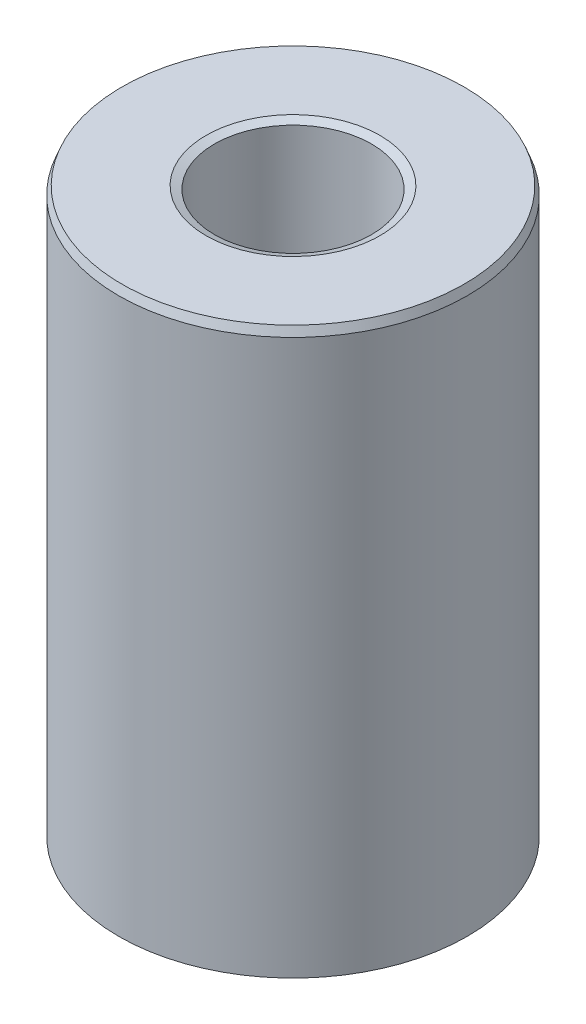
ISO-10303-21;
HEADER;
FILE_DESCRIPTION(('STEP AP214'),'2;1');
FILE_NAME('part.step','',(''),(''),'','','');
FILE_SCHEMA(('AUTOMOTIVE_DESIGN { 1 0 10303 214 1 1 1 1 }'));
ENDSEC;
DATA;
#1=APPLICATION_CONTEXT('core data for automotive mechanical design processes');
#2=APPLICATION_PROTOCOL_DEFINITION('international standard','automotive_design',2000,#1);
#3=PRODUCT_CONTEXT('',#1,'mechanical');
#4=PRODUCT('Part','Part','',(#3));
#5=PRODUCT_RELATED_PRODUCT_CATEGORY('part','',(#4));
#6=PRODUCT_DEFINITION_FORMATION('','',#4);
#7=PRODUCT_DEFINITION_CONTEXT('part definition',#1,'design');
#8=PRODUCT_DEFINITION('design','',#6,#7);
#9=PRODUCT_DEFINITION_SHAPE('','',#8);
#10=(LENGTH_UNIT() NAMED_UNIT(*) SI_UNIT(.MILLI.,.METRE.));
#11=(NAMED_UNIT(*) PLANE_ANGLE_UNIT() SI_UNIT($,.RADIAN.));
#12=(NAMED_UNIT(*) SI_UNIT($,.STERADIAN.) SOLID_ANGLE_UNIT());
#13=UNCERTAINTY_MEASURE_WITH_UNIT(LENGTH_MEASURE(1.E-05),#10,'distance_accuracy_value','');
#14=(GEOMETRIC_REPRESENTATION_CONTEXT(3) GLOBAL_UNCERTAINTY_ASSIGNED_CONTEXT((#13)) GLOBAL_UNIT_ASSIGNED_CONTEXT((#10,
#11,#12)) REPRESENTATION_CONTEXT('',''));
#15=CARTESIAN_POINT('',(0.,0.,0.));
#16=DIRECTION('',(0.,0.,1.));
#17=DIRECTION('',(1.,0.,0.));
#18=AXIS2_PLACEMENT_3D('',#15,#16,#17);
#19=CARTESIAN_POINT('',(0.,130.047355790658,0.));
#20=DIRECTION('',(0.,-1.,0.));
#21=DIRECTION('',(0.,0.,-1.));
#22=AXIS2_PLACEMENT_3D('',#19,#20,#21);
#23=CYLINDRICAL_SURFACE('',#22,40.);
#24=CARTESIAN_POINT('',(0.,0.740756808250698,0.));
#25=DIRECTION('',(0.,1.,0.));
#26=DIRECTION('',(0.,0.,1.));
#27=AXIS2_PLACEMENT_3D('',#24,#25,#26);
#28=CIRCLE('',#27,40.);
#29=CARTESIAN_POINT('',(0.,0.740756808250698,40.));
#30=VERTEX_POINT('',#29);
#31=EDGE_CURVE('E10',#30,#30,#28,.T.);
#32=ORIENTED_EDGE('',*,*,#31,.T.);
#33=EDGE_LOOP('',(#32));
#34=FACE_BOUND('',#33,.T.);
#35=CARTESIAN_POINT('',(0.,128.124007330979,0.));
#36=DIRECTION('',(0.,1.,0.));
#37=DIRECTION('',(0.,0.,1.));
#38=AXIS2_PLACEMENT_3D('',#35,#36,#37);
#39=CIRCLE('',#38,40.);
#40=CARTESIAN_POINT('',(0.,128.124007330979,-40.));
#41=VERTEX_POINT('',#40);
#42=EDGE_CURVE('E50',#41,#41,#39,.F.);
#43=ORIENTED_EDGE('',*,*,#42,.T.);
#44=EDGE_LOOP('',(#43));
#45=FACE_BOUND('',#44,.T.);
#46=ADVANCED_FACE('F39',(#34,#45),#23,.T.);
#47=CARTESIAN_POINT('',(0.,130.047355790658,0.));
#48=DIRECTION('',(0.,1.,0.));
#49=DIRECTION('',(0.,0.,1.));
#50=AXIS2_PLACEMENT_3D('',#47,#48,#49);
#51=PLANE('',#50);
#52=CARTESIAN_POINT('',(0.,130.047355790658,0.));
#53=DIRECTION('',(0.,1.,0.));
#54=DIRECTION('',(0.,0.,1.));
#55=AXIS2_PLACEMENT_3D('',#52,#53,#54);
#56=CIRCLE('',#55,19.9612503892838);
#57=CARTESIAN_POINT('',(0.,130.047355790658,19.9612503892838));
#58=VERTEX_POINT('',#57);
#59=EDGE_CURVE('E58',#58,#58,#56,.F.);
#60=ORIENTED_EDGE('',*,*,#59,.T.);
#61=EDGE_LOOP('',(#60));
#62=FACE_BOUND('',#61,.T.);
#63=CARTESIAN_POINT('',(0.,130.047355790658,0.));
#64=DIRECTION('',(0.,1.,0.));
#65=DIRECTION('',(0.,0.,1.));
#66=AXIS2_PLACEMENT_3D('',#63,#64,#65);
#67=CIRCLE('',#66,39.2592431917493);
#68=CARTESIAN_POINT('',(0.,130.047355790658,-39.2592431917493));
#69=VERTEX_POINT('',#68);
#70=EDGE_CURVE('E61',#69,#69,#67,.T.);
#71=ORIENTED_EDGE('',*,*,#70,.T.);
#72=EDGE_LOOP('',(#71));
#73=FACE_BOUND('',#72,.T.);
#74=ADVANCED_FACE('F88',(#62,#73),#51,.T.);
#75=CARTESIAN_POINT('',(0.,0.,0.));
#76=DIRECTION('',(0.,1.,0.));
#77=DIRECTION('',(0.,0.,1.));
#78=AXIS2_PLACEMENT_3D('',#75,#76,#77);
#79=PLANE('',#78);
#80=CARTESIAN_POINT('',(0.,0.,0.));
#81=DIRECTION('',(0.,1.,0.));
#82=DIRECTION('',(0.,0.,1.));
#83=AXIS2_PLACEMENT_3D('',#80,#81,#82);
#84=CIRCLE('',#83,18.778658737856);
#85=CARTESIAN_POINT('',(0.,0.,-18.778658737856));
#86=VERTEX_POINT('',#85);
#87=EDGE_CURVE('E51',#86,#86,#84,.T.);
#88=ORIENTED_EDGE('',*,*,#87,.T.);
#89=EDGE_LOOP('',(#88));
#90=FACE_BOUND('',#89,.T.);
#91=CARTESIAN_POINT('',(0.,0.,0.));
#92=DIRECTION('',(0.,1.,0.));
#93=DIRECTION('',(0.,0.,1.));
#94=AXIS2_PLACEMENT_3D('',#91,#92,#93);
#95=CIRCLE('',#94,38.0766515403214);
#96=CARTESIAN_POINT('',(0.,0.,38.0766515403214));
#97=VERTEX_POINT('',#96);
#98=EDGE_CURVE('E54',#97,#97,#95,.F.);
#99=ORIENTED_EDGE('',*,*,#98,.T.);
#100=EDGE_LOOP('',(#99));
#101=FACE_BOUND('',#100,.T.);
#102=ADVANCED_FACE('F83',(#90,#101),#79,.F.);
#103=CARTESIAN_POINT('',(0.,130.047355790658,0.));
#104=DIRECTION('',(0.,-1.,0.));
#105=DIRECTION('',(0.,0.,-1.));
#106=AXIS2_PLACEMENT_3D('',#103,#104,#105);
#107=CYLINDRICAL_SURFACE('',#106,18.0379019296053);
#108=CARTESIAN_POINT('',(0.,129.306598982407,0.));
#109=DIRECTION('',(0.,1.,0.));
#110=DIRECTION('',(0.,0.,1.));
#111=AXIS2_PLACEMENT_3D('',#108,#109,#110);
#112=CIRCLE('',#111,18.0379019296053);
#113=CARTESIAN_POINT('',(0.,129.306598982407,18.0379019296053));
#114=VERTEX_POINT('',#113);
#115=EDGE_CURVE('E67',#114,#114,#112,.T.);
#116=ORIENTED_EDGE('',*,*,#115,.T.);
#117=EDGE_LOOP('',(#116));
#118=FACE_BOUND('',#117,.T.);
#119=CARTESIAN_POINT('',(0.,1.92334845967856,0.));
#120=DIRECTION('',(0.,1.,0.));
#121=DIRECTION('',(0.,0.,1.));
#122=AXIS2_PLACEMENT_3D('',#119,#120,#121);
#123=CIRCLE('',#122,18.0379019296053);
#124=CARTESIAN_POINT('',(0.,1.92334845967856,-18.0379019296053));
#125=VERTEX_POINT('',#124);
#126=EDGE_CURVE('E69',#125,#125,#123,.F.);
#127=ORIENTED_EDGE('',*,*,#126,.T.);
#128=EDGE_LOOP('',(#127));
#129=FACE_BOUND('',#128,.T.);
#130=ADVANCED_FACE('F71',(#118,#129),#107,.F.);
#131=CARTESIAN_POINT('',(0.,129.306598982407,0.));
#132=DIRECTION('',(0.,1.,0.));
#133=DIRECTION('',(0.,0.,1.));
#134=AXIS2_PLACEMENT_3D('',#131,#132,#133);
#135=CONICAL_SURFACE('',#134,18.0379019296053,1.20316629536968);
#136=ORIENTED_EDGE('',*,*,#59,.F.);
#137=EDGE_LOOP('',(#136));
#138=FACE_BOUND('',#137,.T.);
#139=ORIENTED_EDGE('',*,*,#115,.F.);
#140=EDGE_LOOP('',(#139));
#141=FACE_BOUND('',#140,.T.);
#142=ADVANCED_FACE('F77',(#138,#141),#135,.F.);
#143=CARTESIAN_POINT('',(0.,0.,0.));
#144=DIRECTION('',(0.,-1.,0.));
#145=DIRECTION('',(0.,0.,-1.));
#146=AXIS2_PLACEMENT_3D('',#143,#144,#145);
#147=CONICAL_SURFACE('',#146,18.778658737856,0.367630031425209);
#148=CARTESIAN_POINT('',(0.,1.92334845967856,-18.0379019296053));
#149=CARTESIAN_POINT('',(0.,1.90331357989025,-18.0456181463579));
#150=CARTESIAN_POINT('',(0.,1.88327870010193,-18.0533343631105));
#151=CARTESIAN_POINT('',(0.,1.84320894052529,-18.0687667966157));
#152=CARTESIAN_POINT('',(0.,1.82317406073697,-18.0764830133684));
#153=CARTESIAN_POINT('',(0.,1.78310430116034,-18.0919154468736));
#154=CARTESIAN_POINT('',(0.,1.76306942137202,-18.0996316636262));
#155=CARTESIAN_POINT('',(0.,1.72299966179538,-18.1150640971314));
#156=CARTESIAN_POINT('',(0.,1.70296478200706,-18.122780313884));
#157=CARTESIAN_POINT('',(0.,1.66289502243043,-18.1382127473892));
#158=CARTESIAN_POINT('',(0.,1.64286014264211,-18.1459289641419));
#159=CARTESIAN_POINT('',(0.,1.60279038306547,-18.1613613976471));
#160=CARTESIAN_POINT('',(0.,1.58275550327715,-18.1690776143997));
#161=CARTESIAN_POINT('',(0.,1.54268574370052,-18.1845100479049));
#162=CARTESIAN_POINT('',(0.,1.5226508639122,-18.1922262646575));
#163=CARTESIAN_POINT('',(0.,1.48258110433556,-18.2076586981627));
#164=CARTESIAN_POINT('',(0.,1.46254622454724,-18.2153749149154));
#165=CARTESIAN_POINT('',(0.,1.4224764649706,-18.2308073484206));
#166=CARTESIAN_POINT('',(0.,1.40244158518229,-18.2385235651732));
#167=CARTESIAN_POINT('',(0.,1.36237182560565,-18.2539559986784));
#168=CARTESIAN_POINT('',(0.,1.34233694581733,-18.261672215431));
#169=CARTESIAN_POINT('',(0.,1.30226718624069,-18.2771046489362));
#170=CARTESIAN_POINT('',(0.,1.28223230645238,-18.2848208656889));
#171=CARTESIAN_POINT('',(0.,1.24216254687574,-18.3002532991941));
#172=CARTESIAN_POINT('',(0.,1.22212766708742,-18.3079695159467));
#173=CARTESIAN_POINT('',(0.,1.18205790751078,-18.3234019494519));
#174=CARTESIAN_POINT('',(0.,1.16202302772247,-18.3311181662045));
#175=CARTESIAN_POINT('',(0.,1.12195326814583,-18.3465505997098));
#176=CARTESIAN_POINT('',(0.,1.10191838835751,-18.3542668164624));
#177=CARTESIAN_POINT('',(0.,1.06184862878087,-18.3696992499676));
#178=CARTESIAN_POINT('',(0.,1.04181374899256,-18.3774154667202));
#179=CARTESIAN_POINT('',(0.,1.00174398941592,-18.3928479002254));
#180=CARTESIAN_POINT('',(0.,0.9817091096276,-18.400564116978));
#181=CARTESIAN_POINT('',(0.,0.941639350050963,-18.4159965504832));
#182=CARTESIAN_POINT('',(0.,0.921604470262645,-18.4237127672359));
#183=CARTESIAN_POINT('',(0.,0.881534710686009,-18.4391452007411));
#184=CARTESIAN_POINT('',(0.,0.86149983089769,-18.4468614174937));
#185=CARTESIAN_POINT('',(0.,0.821430071321053,-18.4622938509989));
#186=CARTESIAN_POINT('',(0.,0.801395191532735,-18.4700100677515));
#187=CARTESIAN_POINT('',(0.,0.761325431956098,-18.4854425012568));
#188=CARTESIAN_POINT('',(0.,0.74129055216778,-18.4931587180094));
#189=CARTESIAN_POINT('',(0.,0.701220792591143,-18.5085911515146));
#190=CARTESIAN_POINT('',(0.,0.681185912802825,-18.5163073682672));
#191=CARTESIAN_POINT('',(0.,0.641116153226188,-18.5317398017724));
#192=CARTESIAN_POINT('',(0.,0.62108127343787,-18.539456018525));
#193=CARTESIAN_POINT('',(0.,0.581011513861233,-18.5548884520303));
#194=CARTESIAN_POINT('',(0.,0.560976634072915,-18.5626046687829));
#195=CARTESIAN_POINT('',(0.,0.520906874496278,-18.5780371022881));
#196=CARTESIAN_POINT('',(0.,0.500871994707959,-18.5857533190407));
#197=CARTESIAN_POINT('',(0.,0.460802235131323,-18.6011857525459));
#198=CARTESIAN_POINT('',(0.,0.440767355343004,-18.6089019692985));
#199=CARTESIAN_POINT('',(0.,0.400697595766368,-18.6243344028038));
#200=CARTESIAN_POINT('',(0.,0.380662715978049,-18.6320506195564));
#201=CARTESIAN_POINT('',(0.,0.340592956401412,-18.6474830530616));
#202=CARTESIAN_POINT('',(0.,0.320558076613094,-18.6551992698142));
#203=CARTESIAN_POINT('',(0.,0.280488317036457,-18.6706317033194));
#204=CARTESIAN_POINT('',(0.,0.260453437248139,-18.678347920072));
#205=CARTESIAN_POINT('',(0.,0.220383677671502,-18.6937803535773));
#206=CARTESIAN_POINT('',(0.,0.200348797883184,-18.7014965703299));
#207=CARTESIAN_POINT('',(0.,0.160279038306547,-18.7169290038351));
#208=CARTESIAN_POINT('',(0.,0.140244158518229,-18.7246452205877));
#209=CARTESIAN_POINT('',(0.,0.100174398941592,-18.7400776540929));
#210=CARTESIAN_POINT('',(0.,0.0801395191532735,-18.7477938708455));
#211=CARTESIAN_POINT('',(0.,0.0400697595766367,-18.7632263043508));
#212=CARTESIAN_POINT('',(0.,0.0200348797883184,-18.7709425211034));
#213=CARTESIAN_POINT('',(0.,0.,-18.778658737856));
#214=B_SPLINE_CURVE_WITH_KNOTS('',3,(#148,#149,#150,#151,#152,#153,#154,#155,#156,#157,#158,
#159,#160,#161,#162,#163,#164,#165,#166,#167,#168,#169,#170,#171,#172,#173,#174,#175,#176,#177,
#178,#179,#180,#181,#182,#183,#184,#185,#186,#187,#188,#189,#190,#191,#192,#193,#194,#195,#196,
#197,#198,#199,#200,#201,#202,#203,#204,#205,#206,#207,#208,#209,#210,#211,#212,#213),
.UNSPECIFIED.,.F.,.F.,(4,2,2,2,2,2,2,2,2,2,2,2,2,2,2,2,2,2,2,2,2,2,2,2,2,2,2,2,2,2,2,2,4),(0.,
0.0644082889227066,0.128816577845413,0.19322486676812,0.257633155690826,0.322041444613533,
0.386449733536239,0.450858022458946,0.515266311381653,0.579674600304359,0.644082889227066,
0.708491178149772,0.772899467072479,0.837307755995186,0.901716044917892,0.966124333840599,
1.0305326227633,1.09494091168601,1.15934920060872,1.22375748953142,1.28816577845413,
1.35257406737684,1.41698235629954,1.48139064522225,1.54579893414496,1.61020722306766,
1.67461551199037,1.73902380091308,1.80343208983578,1.86784037875849,1.9322486676812,
1.9966569566039,2.06106524552661),.UNSPECIFIED.);
#215=EDGE_CURVE('BSEAM73',#125,#86,#214,.T.);
#216=ORIENTED_EDGE('',*,*,#126,.F.);
#217=ORIENTED_EDGE('',*,*,#87,.F.);
#218=ORIENTED_EDGE('',*,*,#215,.T.);
#219=ORIENTED_EDGE('',*,*,#215,.F.);
#220=EDGE_LOOP('',(#216,#218,#217,#219));
#221=FACE_BOUND('',#220,.T.);
#222=ADVANCED_FACE('F73',(#221),#147,.F.);
#223=CARTESIAN_POINT('',(0.,0.740756808250698,0.));
#224=DIRECTION('',(0.,1.,0.));
#225=DIRECTION('',(0.,0.,1.));
#226=AXIS2_PLACEMENT_3D('',#223,#224,#225);
#227=CONICAL_SURFACE('',#226,40.,1.20316629536969);
#228=ORIENTED_EDGE('',*,*,#98,.F.);
#229=EDGE_LOOP('',(#228));
#230=FACE_BOUND('',#229,.T.);
#231=ORIENTED_EDGE('',*,*,#31,.F.);
#232=EDGE_LOOP('',(#231));
#233=FACE_BOUND('',#232,.T.);
#234=ADVANCED_FACE('F76',(#230,#233),#227,.T.);
#235=CARTESIAN_POINT('',(0.,130.047355790658,0.));
#236=DIRECTION('',(0.,-1.,0.));
#237=DIRECTION('',(0.,0.,-1.));
#238=AXIS2_PLACEMENT_3D('',#235,#236,#237);
#239=CONICAL_SURFACE('',#238,39.2592431917493,0.36763003142521);
#240=CARTESIAN_POINT('',(0.,128.124007330979,-40.));
#241=CARTESIAN_POINT('',(0.,128.144042210768,-39.9922837832474));
#242=CARTESIAN_POINT('',(0.,128.164077090556,-39.9845675664948));
#243=CARTESIAN_POINT('',(0.,128.204146850133,-39.9691351329896));
#244=CARTESIAN_POINT('',(0.,128.224181729921,-39.961418916237));
#245=CARTESIAN_POINT('',(0.,128.264251489498,-39.9459864827317));
#246=CARTESIAN_POINT('',(0.,128.284286369286,-39.9382702659791));
#247=CARTESIAN_POINT('',(0.,128.324356128862,-39.9228378324739));
#248=CARTESIAN_POINT('',(0.,128.344391008651,-39.9151216157213));
#249=CARTESIAN_POINT('',(0.,128.384460768227,-39.8996891822161));
#250=CARTESIAN_POINT('',(0.,128.404495648016,-39.8919729654634));
#251=CARTESIAN_POINT('',(0.,128.444565407592,-39.8765405319582));
#252=CARTESIAN_POINT('',(0.,128.464600287381,-39.8688243152056));
#253=CARTESIAN_POINT('',(0.,128.504670046957,-39.8533918817004));
#254=CARTESIAN_POINT('',(0.,128.524704926746,-39.8456756649478));
#255=CARTESIAN_POINT('',(0.,128.564774686322,-39.8302432314425));
#256=CARTESIAN_POINT('',(0.,128.584809566111,-39.8225270146899));
#257=CARTESIAN_POINT('',(0.,128.624879325687,-39.8070945811847));
#258=CARTESIAN_POINT('',(0.,128.644914205476,-39.7993783644321));
#259=CARTESIAN_POINT('',(0.,128.684983965052,-39.7839459309269));
#260=CARTESIAN_POINT('',(0.,128.705018844841,-39.7762297141743));
#261=CARTESIAN_POINT('',(0.,128.745088604417,-39.760797280669));
#262=CARTESIAN_POINT('',(0.,128.765123484205,-39.7530810639164));
#263=CARTESIAN_POINT('',(0.,128.805193243782,-39.7376486304112));
#264=CARTESIAN_POINT('',(0.,128.82522812357,-39.7299324136586));
#265=CARTESIAN_POINT('',(0.,128.865297883147,-39.7144999801534));
#266=CARTESIAN_POINT('',(0.,128.885332762935,-39.7067837634008));
#267=CARTESIAN_POINT('',(0.,128.925402522512,-39.6913513298955));
#268=CARTESIAN_POINT('',(0.,128.9454374023,-39.6836351131429));
#269=CARTESIAN_POINT('',(0.,128.985507161877,-39.6682026796377));
#270=CARTESIAN_POINT('',(0.,129.005542041665,-39.6604864628851));
#271=CARTESIAN_POINT('',(0.,129.045611801242,-39.6450540293799));
#272=CARTESIAN_POINT('',(0.,129.06564668103,-39.6373378126273));
#273=CARTESIAN_POINT('',(0.,129.105716440607,-39.621905379122));
#274=CARTESIAN_POINT('',(0.,129.125751320395,-39.6141891623694));
#275=CARTESIAN_POINT('',(0.,129.165821079972,-39.5987567288642));
#276=CARTESIAN_POINT('',(0.,129.18585595976,-39.5910405121116));
#277=CARTESIAN_POINT('',(0.,129.225925719337,-39.5756080786064));
#278=CARTESIAN_POINT('',(0.,129.245960599125,-39.5678918618538));
#279=CARTESIAN_POINT('',(0.,129.286030358702,-39.5524594283485));
#280=CARTESIAN_POINT('',(0.,129.30606523849,-39.5447432115959));
#281=CARTESIAN_POINT('',(0.,129.346134998067,-39.5293107780907));
#282=CARTESIAN_POINT('',(0.,129.366169877855,-39.5215945613381));
#283=CARTESIAN_POINT('',(0.,129.406239637432,-39.5061621278329));
#284=CARTESIAN_POINT('',(0.,129.42627451722,-39.4984459110803));
#285=CARTESIAN_POINT('',(0.,129.466344276797,-39.483013477575));
#286=CARTESIAN_POINT('',(0.,129.486379156585,-39.4752972608224));
#287=CARTESIAN_POINT('',(0.,129.526448916162,-39.4598648273172));
#288=CARTESIAN_POINT('',(0.,129.54648379595,-39.4521486105646));
#289=CARTESIAN_POINT('',(0.,129.586553555527,-39.4367161770594));
#290=CARTESIAN_POINT('',(0.,129.606588435315,-39.4289999603067));
#291=CARTESIAN_POINT('',(0.,129.646658194892,-39.4135675268015));
#292=CARTESIAN_POINT('',(0.,129.66669307468,-39.4058513100489));
#293=CARTESIAN_POINT('',(0.,129.706762834256,-39.3904188765437));
#294=CARTESIAN_POINT('',(0.,129.726797714045,-39.3827026597911));
#295=CARTESIAN_POINT('',(0.,129.766867473621,-39.3672702262858));
#296=CARTESIAN_POINT('',(0.,129.78690235341,-39.3595540095332));
#297=CARTESIAN_POINT('',(0.,129.826972112986,-39.344121576028));
#298=CARTESIAN_POINT('',(0.,129.847006992775,-39.3364053592754));
#299=CARTESIAN_POINT('',(0.,129.887076752351,-39.3209729257702));
#300=CARTESIAN_POINT('',(0.,129.90711163214,-39.3132567090176));
#301=CARTESIAN_POINT('',(0.,129.947181391716,-39.2978242755123));
#302=CARTESIAN_POINT('',(0.,129.967216271505,-39.2901080587597));
#303=CARTESIAN_POINT('',(0.,130.007286031081,-39.2746756252545));
#304=CARTESIAN_POINT('',(0.,130.02732091087,-39.2669594085019));
#305=CARTESIAN_POINT('',(0.,130.047355790658,-39.2592431917493));
#306=B_SPLINE_CURVE_WITH_KNOTS('',3,(#240,#241,#242,#243,#244,#245,#246,#247,#248,#249,#250,
#251,#252,#253,#254,#255,#256,#257,#258,#259,#260,#261,#262,#263,#264,#265,#266,#267,#268,#269,
#270,#271,#272,#273,#274,#275,#276,#277,#278,#279,#280,#281,#282,#283,#284,#285,#286,#287,#288,
#289,#290,#291,#292,#293,#294,#295,#296,#297,#298,#299,#300,#301,#302,#303,#304,#305),
.UNSPECIFIED.,.F.,.F.,(4,2,2,2,2,2,2,2,2,2,2,2,2,2,2,2,2,2,2,2,2,2,2,2,2,2,2,2,2,2,2,2,4),(0.,
0.0644082889227325,0.128816577845439,0.193224866768146,0.257633155690855,0.322041444613561,
0.386449733536268,0.450858022458974,0.515266311381681,0.579674600304388,0.644082889227094,
0.708491178149801,0.772899467072507,0.837307755995214,0.901716044917923,0.966124333840629,
1.03053262276334,1.09494091168607,1.15934920060878,1.22375748953148,1.28816577845419,
1.3525740673769,1.4169823562996,1.48139064522231,1.54579893414502,1.61020722306772,
1.67461551199043,1.73902380091314,1.80343208983584,1.86784037875855,1.93224866768126,
1.99665695660396,2.0610652455267),.UNSPECIFIED.);
#307=EDGE_CURVE('BSEAM45',#41,#69,#306,.T.);
#308=ORIENTED_EDGE('',*,*,#42,.F.);
#309=ORIENTED_EDGE('',*,*,#70,.F.);
#310=ORIENTED_EDGE('',*,*,#307,.T.);
#311=ORIENTED_EDGE('',*,*,#307,.F.);
#312=EDGE_LOOP('',(#308,#310,#309,#311));
#313=FACE_BOUND('',#312,.T.);
#314=ADVANCED_FACE('F45',(#313),#239,.T.);
#315=CLOSED_SHELL('',(#46,#74,#102,#130,#142,#222,#234,#314));
#316=MANIFOLD_SOLID_BREP('B2',#315);
#317=ADVANCED_BREP_SHAPE_REPRESENTATION('',(#18,#316),#14);
#318=SHAPE_DEFINITION_REPRESENTATION(#9,#317);
ENDSEC;
END-ISO-10303-21;
